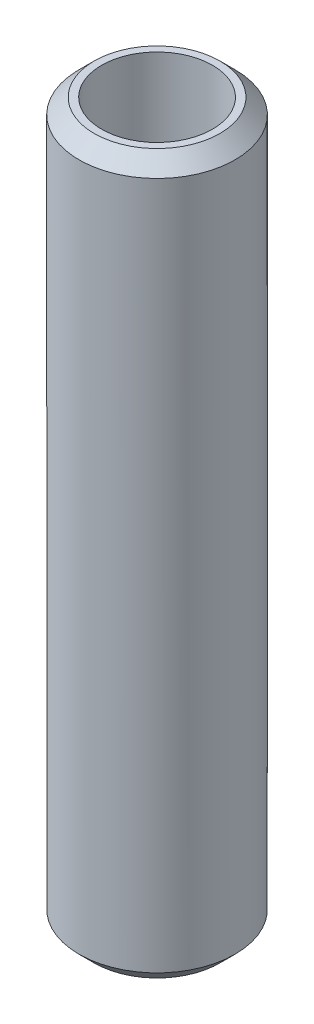
ISO-10303-21;
HEADER;
FILE_DESCRIPTION(('STEP AP214'),'2;1');
FILE_NAME('part.step','',(''),(''),'','','');
FILE_SCHEMA(('AUTOMOTIVE_DESIGN { 1 0 10303 214 1 1 1 1 }'));
ENDSEC;
DATA;
#1=APPLICATION_CONTEXT('core data for automotive mechanical design processes');
#2=APPLICATION_PROTOCOL_DEFINITION('international standard','automotive_design',2000,#1);
#3=PRODUCT_CONTEXT('',#1,'mechanical');
#4=PRODUCT('Part','Part','',(#3));
#5=PRODUCT_RELATED_PRODUCT_CATEGORY('part','',(#4));
#6=PRODUCT_DEFINITION_FORMATION('','',#4);
#7=PRODUCT_DEFINITION_CONTEXT('part definition',#1,'design');
#8=PRODUCT_DEFINITION('design','',#6,#7);
#9=PRODUCT_DEFINITION_SHAPE('','',#8);
#10=(LENGTH_UNIT() NAMED_UNIT(*) SI_UNIT(.MILLI.,.METRE.));
#11=(NAMED_UNIT(*) PLANE_ANGLE_UNIT() SI_UNIT($,.RADIAN.));
#12=(NAMED_UNIT(*) SI_UNIT($,.STERADIAN.) SOLID_ANGLE_UNIT());
#13=UNCERTAINTY_MEASURE_WITH_UNIT(LENGTH_MEASURE(1.E-05),#10,'distance_accuracy_value','');
#14=(GEOMETRIC_REPRESENTATION_CONTEXT(3) GLOBAL_UNCERTAINTY_ASSIGNED_CONTEXT((#13)) GLOBAL_UNIT_ASSIGNED_CONTEXT((#10,
#11,#12)) REPRESENTATION_CONTEXT('',''));
#15=CARTESIAN_POINT('',(0.,0.,0.));
#16=DIRECTION('',(0.,0.,1.));
#17=DIRECTION('',(1.,0.,0.));
#18=AXIS2_PLACEMENT_3D('',#15,#16,#17);
#19=CARTESIAN_POINT('',(0.,138.051908771959,0.));
#20=DIRECTION('',(0.,-1.,0.));
#21=DIRECTION('',(0.,0.,-1.));
#22=AXIS2_PLACEMENT_3D('',#19,#20,#21);
#23=CYLINDRICAL_SURFACE('',#22,15.);
#24=CARTESIAN_POINT('',(0.,135.132549259896,0.));
#25=DIRECTION('',(0.,1.,0.));
#26=DIRECTION('',(0.,0.,1.));
#27=AXIS2_PLACEMENT_3D('',#24,#25,#26);
#28=CIRCLE('',#27,15.);
#29=CARTESIAN_POINT('',(0.,135.132549259896,-15.));
#30=VERTEX_POINT('',#29);
#31=EDGE_CURVE('E50',#30,#30,#28,.F.);
#32=CARTESIAN_POINT('',(0.,2.91935951206257,0.));
#33=DIRECTION('',(0.,1.,0.));
#34=DIRECTION('',(0.,0.,1.));
#35=AXIS2_PLACEMENT_3D('',#32,#33,#34);
#36=CIRCLE('',#35,15.);
#37=CARTESIAN_POINT('',(0.,2.91935951206254,-15.));
#38=VERTEX_POINT('',#37);
#39=EDGE_CURVE('E51',#38,#38,#36,.T.);
#40=CARTESIAN_POINT('',(0.,135.132549259896,-15.));
#41=CARTESIAN_POINT('',(0.,133.755328533356,-15.));
#42=CARTESIAN_POINT('',(0.,132.378107806816,-15.));
#43=CARTESIAN_POINT('',(0.,129.623666353737,-15.));
#44=CARTESIAN_POINT('',(0.,128.246445627197,-15.));
#45=CARTESIAN_POINT('',(0.,125.492004174117,-15.));
#46=CARTESIAN_POINT('',(0.,124.114783447577,-15.));
#47=CARTESIAN_POINT('',(0.,121.360341994497,-15.));
#48=CARTESIAN_POINT('',(0.,119.983121267957,-15.));
#49=CARTESIAN_POINT('',(0.,117.228679814877,-15.));
#50=CARTESIAN_POINT('',(0.,115.851459088337,-15.));
#51=CARTESIAN_POINT('',(0.,113.097017635257,-15.));
#52=CARTESIAN_POINT('',(0.,111.719796908717,-15.));
#53=CARTESIAN_POINT('',(0.,108.965355455638,-15.));
#54=CARTESIAN_POINT('',(0.,107.588134729098,-15.));
#55=CARTESIAN_POINT('',(0.,104.833693276018,-15.));
#56=CARTESIAN_POINT('',(0.,103.456472549478,-15.));
#57=CARTESIAN_POINT('',(0.,100.702031096398,-15.));
#58=CARTESIAN_POINT('',(0.,99.324810369858,-15.));
#59=CARTESIAN_POINT('',(0.,96.5703689167782,-15.));
#60=CARTESIAN_POINT('',(0.,95.1931481902382,-15.));
#61=CARTESIAN_POINT('',(0.,92.4387067371584,-15.));
#62=CARTESIAN_POINT('',(0.,91.0614860106184,-15.));
#63=CARTESIAN_POINT('',(0.,88.3070445575386,-15.));
#64=CARTESIAN_POINT('',(0.,86.9298238309986,-15.));
#65=CARTESIAN_POINT('',(0.,84.1753823779187,-15.));
#66=CARTESIAN_POINT('',(0.,82.7981616513788,-15.));
#67=CARTESIAN_POINT('',(0.,80.0437201982989,-15.));
#68=CARTESIAN_POINT('',(0.,78.666499471759,-15.));
#69=CARTESIAN_POINT('',(0.,75.9120580186791,-15.));
#70=CARTESIAN_POINT('',(0.,74.5348372921392,-15.));
#71=CARTESIAN_POINT('',(0.,71.7803958390593,-15.));
#72=CARTESIAN_POINT('',(0.,70.4031751125194,-15.));
#73=CARTESIAN_POINT('',(0.,67.6487336594395,-15.));
#74=CARTESIAN_POINT('',(0.,66.2715129328996,-15.));
#75=CARTESIAN_POINT('',(0.,63.5170714798197,-15.));
#76=CARTESIAN_POINT('',(0.,62.1398507532798,-15.));
#77=CARTESIAN_POINT('',(0.,59.3854093001999,-15.));
#78=CARTESIAN_POINT('',(0.,58.00818857366,-15.));
#79=CARTESIAN_POINT('',(0.,55.2537471205801,-15.));
#80=CARTESIAN_POINT('',(0.,53.8765263940402,-15.));
#81=CARTESIAN_POINT('',(0.,51.1220849409603,-15.));
#82=CARTESIAN_POINT('',(0.,49.7448642144204,-15.));
#83=CARTESIAN_POINT('',(0.,46.9904227613405,-15.));
#84=CARTESIAN_POINT('',(0.,45.6132020348006,-15.));
#85=CARTESIAN_POINT('',(0.,42.8587605817207,-15.));
#86=CARTESIAN_POINT('',(0.,41.4815398551807,-15.));
#87=CARTESIAN_POINT('',(0.,38.7270984021009,-15.));
#88=CARTESIAN_POINT('',(0.,37.3498776755609,-15.));
#89=CARTESIAN_POINT('',(0.,34.5954362224811,-15.));
#90=CARTESIAN_POINT('',(0.,33.2182154959411,-15.));
#91=CARTESIAN_POINT('',(0.,30.4637740428613,-15.));
#92=CARTESIAN_POINT('',(0.,29.0865533163213,-15.));
#93=CARTESIAN_POINT('',(0.,26.3321118632414,-15.));
#94=CARTESIAN_POINT('',(0.,24.9548911367015,-15.));
#95=CARTESIAN_POINT('',(0.,22.2004496836216,-15.));
#96=CARTESIAN_POINT('',(0.,20.8232289570817,-15.));
#97=CARTESIAN_POINT('',(0.,18.0687875040018,-15.));
#98=CARTESIAN_POINT('',(0.,16.6915667774619,-15.));
#99=CARTESIAN_POINT('',(0.,13.937125324382,-15.));
#100=CARTESIAN_POINT('',(0.,12.5599045978421,-15.));
#101=CARTESIAN_POINT('',(0.,9.80546314476222,-15.));
#102=CARTESIAN_POINT('',(0.,8.42824241822228,-15.));
#103=CARTESIAN_POINT('',(0.,5.67380096514241,-15.));
#104=CARTESIAN_POINT('',(0.,4.29658023860248,-15.));
#105=CARTESIAN_POINT('',(0.,2.91935951206254,-15.));
#106=B_SPLINE_CURVE_WITH_KNOTS('',3,(#40,#41,#42,#43,#44,#45,#46,#47,#48,#49,#50,#51,#52,#53,
#54,#55,#56,#57,#58,#59,#60,#61,#62,#63,#64,#65,#66,#67,#68,#69,#70,#71,#72,#73,#74,#75,#76,#77,
#78,#79,#80,#81,#82,#83,#84,#85,#86,#87,#88,#89,#90,#91,#92,#93,#94,#95,#96,#97,#98,#99,#100,
#101,#102,#103,#104,#105),.UNSPECIFIED.,.F.,.F.,(4,2,2,2,2,2,2,2,2,2,2,2,2,2,2,2,2,2,2,2,2,2,2,
2,2,2,2,2,2,2,2,2,4),(0.,4.1316621796198,8.2633243592396,12.3949865388594,16.5266487184792,
20.658310898099,24.7899730777188,28.9216352573386,33.0532974369584,37.1849596165782,
41.316621796198,45.4482839758179,49.5799461554377,53.7116083350575,57.8432705146773,
61.9749326942971,66.1065948739169,70.2382570535367,74.3699192331565,78.5015814127763,
82.6332435923961,86.7649057720159,90.8965679516357,95.0282301312555,99.1598923108753,
103.291554490495,107.423216670115,111.554878849735,115.686541029355,119.818203208974,
123.949865388594,128.081527568214,132.213189747834),.UNSPECIFIED.);
#107=EDGE_CURVE('BSEAM39',#30,#38,#106,.T.);
#108=ORIENTED_EDGE('',*,*,#31,.T.);
#109=ORIENTED_EDGE('',*,*,#39,.T.);
#110=ORIENTED_EDGE('',*,*,#107,.T.);
#111=ORIENTED_EDGE('',*,*,#107,.F.);
#112=EDGE_LOOP('',(#108,#110,#109,#111));
#113=FACE_BOUND('',#112,.T.);
#114=ADVANCED_FACE('F39',(#113),#23,.T.);
#115=CARTESIAN_POINT('',(0.,138.051908771959,0.));
#116=DIRECTION('',(0.,1.,0.));
#117=DIRECTION('',(0.,0.,1.));
#118=AXIS2_PLACEMENT_3D('',#115,#116,#117);
#119=PLANE('',#118);
#120=CARTESIAN_POINT('',(0.,138.051908771959,0.));
#121=DIRECTION('',(0.,1.,0.));
#122=DIRECTION('',(0.,0.,1.));
#123=AXIS2_PLACEMENT_3D('',#120,#121,#122);
#124=CIRCLE('',#123,12.0806404879375);
#125=CARTESIAN_POINT('',(0.,138.051908771959,12.0806404879375));
#126=VERTEX_POINT('',#125);
#127=EDGE_CURVE('E54',#126,#126,#124,.T.);
#128=ORIENTED_EDGE('',*,*,#127,.T.);
#129=EDGE_LOOP('',(#128));
#130=FACE_BOUND('',#129,.T.);
#131=CARTESIAN_POINT('',(0.,138.051908771959,0.));
#132=DIRECTION('',(0.,1.,0.));
#133=DIRECTION('',(0.,0.,1.));
#134=AXIS2_PLACEMENT_3D('',#131,#132,#133);
#135=CIRCLE('',#134,10.6574953099887);
#136=CARTESIAN_POINT('',(0.,138.051908771959,-10.6574953099887));
#137=VERTEX_POINT('',#136);
#138=EDGE_CURVE('E58',#137,#137,#135,.T.);
#139=ORIENTED_EDGE('',*,*,#138,.F.);
#140=EDGE_LOOP('',(#139));
#141=FACE_BOUND('',#140,.T.);
#142=ADVANCED_FACE('F69',(#130,#141),#119,.T.);
#143=CARTESIAN_POINT('',(0.,0.,0.));
#144=DIRECTION('',(0.,1.,0.));
#145=DIRECTION('',(0.,0.,1.));
#146=AXIS2_PLACEMENT_3D('',#143,#144,#145);
#147=PLANE('',#146);
#148=CARTESIAN_POINT('',(0.,0.,0.));
#149=DIRECTION('',(0.,1.,0.));
#150=DIRECTION('',(0.,0.,1.));
#151=AXIS2_PLACEMENT_3D('',#148,#149,#150);
#152=CIRCLE('',#151,12.0806404879374);
#153=CARTESIAN_POINT('',(0.,0.,12.0806404879374));
#154=VERTEX_POINT('',#153);
#155=EDGE_CURVE('E10',#154,#154,#152,.F.);
#156=ORIENTED_EDGE('',*,*,#155,.T.);
#157=EDGE_LOOP('',(#156));
#158=FACE_BOUND('',#157,.T.);
#159=CARTESIAN_POINT('',(0.,0.,0.));
#160=DIRECTION('',(0.,1.,0.));
#161=DIRECTION('',(0.,0.,1.));
#162=AXIS2_PLACEMENT_3D('',#159,#160,#161);
#163=CIRCLE('',#162,10.6574953099887);
#164=CARTESIAN_POINT('',(0.,0.,-10.6574953099887));
#165=VERTEX_POINT('',#164);
#166=EDGE_CURVE('E63',#165,#165,#163,.T.);
#167=ORIENTED_EDGE('',*,*,#166,.T.);
#168=EDGE_LOOP('',(#167));
#169=FACE_BOUND('',#168,.T.);
#170=ADVANCED_FACE('F75',(#158,#169),#147,.F.);
#171=CARTESIAN_POINT('',(0.,138.051908771959,0.));
#172=DIRECTION('',(0.,-1.,0.));
#173=DIRECTION('',(0.,0.,-1.));
#174=AXIS2_PLACEMENT_3D('',#171,#172,#173);
#175=CYLINDRICAL_SURFACE('',#174,10.6574953099887);
#176=CARTESIAN_POINT('',(0.,138.051908771959,-10.6574953099887));
#177=CARTESIAN_POINT('',(0.,136.613868055584,-10.6574953099887));
#178=CARTESIAN_POINT('',(0.,135.17582733921,-10.6574953099887));
#179=CARTESIAN_POINT('',(0.,132.299745906461,-10.6574953099887));
#180=CARTESIAN_POINT('',(0.,130.861705190086,-10.6574953099887));
#181=CARTESIAN_POINT('',(0.,127.985623757337,-10.6574953099887));
#182=CARTESIAN_POINT('',(0.,126.547583040962,-10.6574953099887));
#183=CARTESIAN_POINT('',(0.,123.671501608213,-10.6574953099887));
#184=CARTESIAN_POINT('',(0.,122.233460891839,-10.6574953099887));
#185=CARTESIAN_POINT('',(0.,119.357379459089,-10.6574953099887));
#186=CARTESIAN_POINT('',(0.,117.919338742715,-10.6574953099887));
#187=CARTESIAN_POINT('',(0.,115.043257309966,-10.6574953099887));
#188=CARTESIAN_POINT('',(0.,113.605216593591,-10.6574953099887));
#189=CARTESIAN_POINT('',(0.,110.729135160842,-10.6574953099887));
#190=CARTESIAN_POINT('',(0.,109.291094444467,-10.6574953099887));
#191=CARTESIAN_POINT('',(0.,106.415013011718,-10.6574953099887));
#192=CARTESIAN_POINT('',(0.,104.976972295344,-10.6574953099887));
#193=CARTESIAN_POINT('',(0.,102.100890862595,-10.6574953099887));
#194=CARTESIAN_POINT('',(0.,100.66285014622,-10.6574953099887));
#195=CARTESIAN_POINT('',(0.,97.7867687134709,-10.6574953099887));
#196=CARTESIAN_POINT('',(0.,96.3487279970963,-10.6574953099887));
#197=CARTESIAN_POINT('',(0.,93.4726465643471,-10.6574953099887));
#198=CARTESIAN_POINT('',(0.,92.0346058479726,-10.6574953099887));
#199=CARTESIAN_POINT('',(0.,89.1585244152234,-10.6574953099887));
#200=CARTESIAN_POINT('',(0.,87.7204836988489,-10.6574953099887));
#201=CARTESIAN_POINT('',(0.,84.8444022660997,-10.6574953099887));
#202=CARTESIAN_POINT('',(0.,83.4063615497251,-10.6574953099887));
#203=CARTESIAN_POINT('',(0.,80.530280116976,-10.6574953099887));
#204=CARTESIAN_POINT('',(0.,79.0922394006014,-10.6574953099887));
#205=CARTESIAN_POINT('',(0.,76.2161579678523,-10.6574953099887));
#206=CARTESIAN_POINT('',(0.,74.7781172514777,-10.6574953099887));
#207=CARTESIAN_POINT('',(0.,71.9020358187286,-10.6574953099887));
#208=CARTESIAN_POINT('',(0.,70.463995102354,-10.6574953099887));
#209=CARTESIAN_POINT('',(0.,67.5879136696049,-10.6574953099887));
#210=CARTESIAN_POINT('',(0.,66.1498729532303,-10.6574953099887));
#211=CARTESIAN_POINT('',(0.,63.2737915204811,-10.6574953099887));
#212=CARTESIAN_POINT('',(0.,61.8357508041066,-10.6574953099887));
#213=CARTESIAN_POINT('',(0.,58.9596693713574,-10.6574953099887));
#214=CARTESIAN_POINT('',(0.,57.5216286549828,-10.6574953099887));
#215=CARTESIAN_POINT('',(0.,54.6455472222337,-10.6574953099887));
#216=CARTESIAN_POINT('',(0.,53.2075065058591,-10.6574953099887));
#217=CARTESIAN_POINT('',(0.,50.33142507311,-10.6574953099887));
#218=CARTESIAN_POINT('',(0.,48.8933843567354,-10.6574953099887));
#219=CARTESIAN_POINT('',(0.,46.0173029239863,-10.6574953099887));
#220=CARTESIAN_POINT('',(0.,44.5792622076117,-10.6574953099887));
#221=CARTESIAN_POINT('',(0.,41.7031807748626,-10.6574953099887));
#222=CARTESIAN_POINT('',(0.,40.265140058488,-10.6574953099887));
#223=CARTESIAN_POINT('',(0.,37.3890586257388,-10.6574953099887));
#224=CARTESIAN_POINT('',(0.,35.9510179093643,-10.6574953099887));
#225=CARTESIAN_POINT('',(0.,33.0749364766151,-10.6574953099887));
#226=CARTESIAN_POINT('',(0.,31.6368957602406,-10.6574953099887));
#227=CARTESIAN_POINT('',(0.,28.7608143274914,-10.6574953099887));
#228=CARTESIAN_POINT('',(0.,27.3227736111168,-10.6574953099887));
#229=CARTESIAN_POINT('',(0.,24.4466921783677,-10.6574953099887));
#230=CARTESIAN_POINT('',(0.,23.0086514619931,-10.6574953099887));
#231=CARTESIAN_POINT('',(0.,20.132570029244,-10.6574953099887));
#232=CARTESIAN_POINT('',(0.,18.6945293128694,-10.6574953099887));
#233=CARTESIAN_POINT('',(0.,15.8184478801203,-10.6574953099887));
#234=CARTESIAN_POINT('',(0.,14.3804071637457,-10.6574953099887));
#235=CARTESIAN_POINT('',(0.,11.5043257309966,-10.6574953099887));
#236=CARTESIAN_POINT('',(0.,10.066285014622,-10.6574953099887));
#237=CARTESIAN_POINT('',(0.,7.19020358187283,-10.6574953099887));
#238=CARTESIAN_POINT('',(0.,5.75216286549826,-10.6574953099887));
#239=CARTESIAN_POINT('',(0.,2.87608143274912,-10.6574953099887));
#240=CARTESIAN_POINT('',(0.,1.43804071637454,-10.6574953099887));
#241=CARTESIAN_POINT('',(0.,0.,-10.6574953099887));
#242=B_SPLINE_CURVE_WITH_KNOTS('',3,(#176,#177,#178,#179,#180,#181,#182,#183,#184,#185,#186,
#187,#188,#189,#190,#191,#192,#193,#194,#195,#196,#197,#198,#199,#200,#201,#202,#203,#204,#205,
#206,#207,#208,#209,#210,#211,#212,#213,#214,#215,#216,#217,#218,#219,#220,#221,#222,#223,#224,
#225,#226,#227,#228,#229,#230,#231,#232,#233,#234,#235,#236,#237,#238,#239,#240,#241),
.UNSPECIFIED.,.F.,.F.,(4,2,2,2,2,2,2,2,2,2,2,2,2,2,2,2,2,2,2,2,2,2,2,2,2,2,2,2,2,2,2,2,4),(0.,
4.31412214912369,8.62824429824741,12.9423664473711,17.2564885964948,21.5706107456186,
25.8847328947423,30.198855043866,34.5129771929897,38.8270993421134,43.1412214912371,
47.4553436403609,51.7694657894846,56.0835879386083,60.397710087732,64.7118322368557,
69.0259543859794,73.3400765351032,77.6541986842269,81.9683208333506,86.2824429824743,
90.596565131598,94.9106872807217,99.2248094298455,103.538931578969,107.853053728093,
112.167175877217,116.48129802634,120.795420175464,125.109542324588,129.423664473711,
133.737786622835,138.051908771959),.UNSPECIFIED.);
#243=EDGE_CURVE('BSEAM70',#137,#165,#242,.T.);
#244=ORIENTED_EDGE('',*,*,#138,.T.);
#245=ORIENTED_EDGE('',*,*,#166,.F.);
#246=ORIENTED_EDGE('',*,*,#243,.T.);
#247=ORIENTED_EDGE('',*,*,#243,.F.);
#248=EDGE_LOOP('',(#244,#246,#245,#247));
#249=FACE_BOUND('',#248,.T.);
#250=ADVANCED_FACE('F70',(#249),#175,.F.);
#251=CARTESIAN_POINT('',(0.,138.051908771959,0.));
#252=DIRECTION('',(0.,-1.,0.));
#253=DIRECTION('',(0.,0.,-1.));
#254=AXIS2_PLACEMENT_3D('',#251,#252,#253);
#255=CONICAL_SURFACE('',#254,12.0806404879375,0.785398163397442);
#256=ORIENTED_EDGE('',*,*,#31,.F.);
#257=EDGE_LOOP('',(#256));
#258=FACE_BOUND('',#257,.T.);
#259=ORIENTED_EDGE('',*,*,#127,.F.);
#260=EDGE_LOOP('',(#259));
#261=FACE_BOUND('',#260,.T.);
#262=ADVANCED_FACE('F81',(#258,#261),#255,.T.);
#263=CARTESIAN_POINT('',(0.,2.91935951206257,0.));
#264=DIRECTION('',(0.,1.,0.));
#265=DIRECTION('',(0.,0.,1.));
#266=AXIS2_PLACEMENT_3D('',#263,#264,#265);
#267=CONICAL_SURFACE('',#266,15.,0.785398163397456);
#268=ORIENTED_EDGE('',*,*,#155,.F.);
#269=EDGE_LOOP('',(#268));
#270=FACE_BOUND('',#269,.T.);
#271=ORIENTED_EDGE('',*,*,#39,.F.);
#272=EDGE_LOOP('',(#271));
#273=FACE_BOUND('',#272,.T.);
#274=ADVANCED_FACE('F45',(#270,#273),#267,.T.);
#275=CLOSED_SHELL('',(#114,#142,#170,#250,#262,#274));
#276=MANIFOLD_SOLID_BREP('B2',#275);
#277=ADVANCED_BREP_SHAPE_REPRESENTATION('',(#18,#276),#14);
#278=SHAPE_DEFINITION_REPRESENTATION(#9,#277);
ENDSEC;
END-ISO-10303-21;
